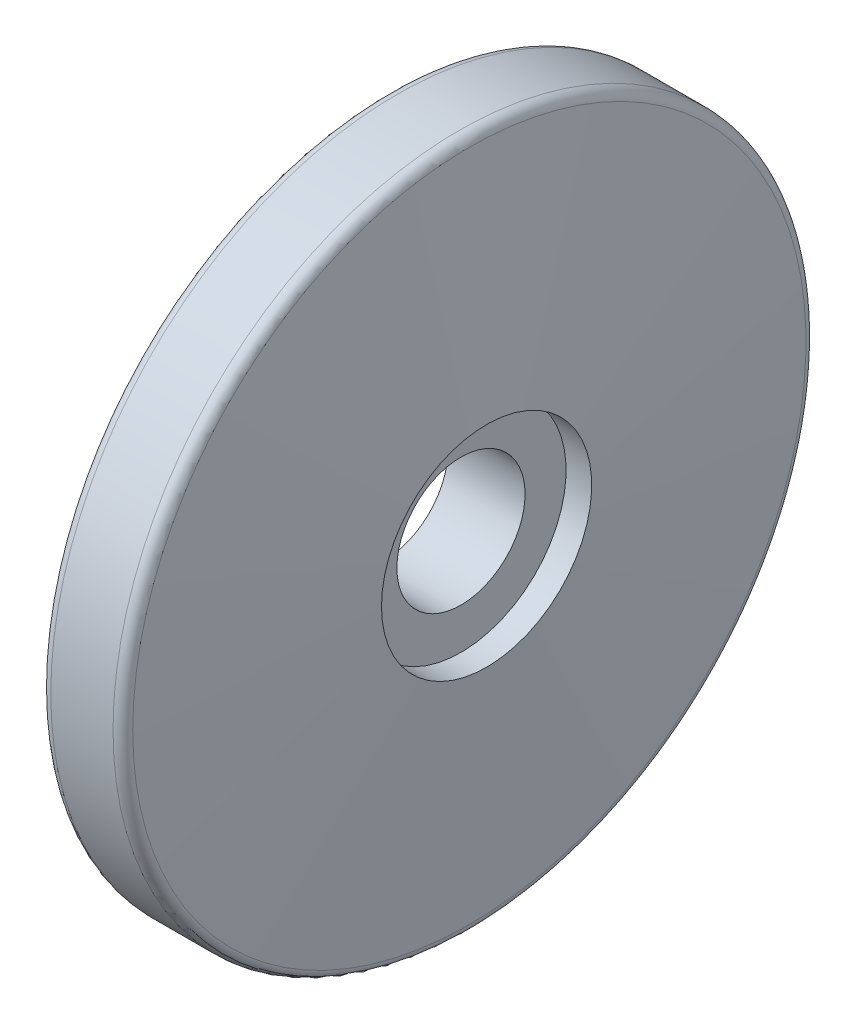
ISO-10303-21;
HEADER;
FILE_DESCRIPTION(('STEP AP214'),'2;1');
FILE_NAME('part.step','',(''),(''),'','','');
FILE_SCHEMA(('AUTOMOTIVE_DESIGN { 1 0 10303 214 1 1 1 1 }'));
ENDSEC;
DATA;
#1=APPLICATION_CONTEXT('core data for automotive mechanical design processes');
#2=APPLICATION_PROTOCOL_DEFINITION('international standard','automotive_design',2000,#1);
#3=PRODUCT_CONTEXT('',#1,'mechanical');
#4=PRODUCT('Part','Part','',(#3));
#5=PRODUCT_RELATED_PRODUCT_CATEGORY('part','',(#4));
#6=PRODUCT_DEFINITION_FORMATION('','',#4);
#7=PRODUCT_DEFINITION_CONTEXT('part definition',#1,'design');
#8=PRODUCT_DEFINITION('design','',#6,#7);
#9=PRODUCT_DEFINITION_SHAPE('','',#8);
#10=(LENGTH_UNIT() NAMED_UNIT(*) SI_UNIT(.MILLI.,.METRE.));
#11=(NAMED_UNIT(*) PLANE_ANGLE_UNIT() SI_UNIT($,.RADIAN.));
#12=(NAMED_UNIT(*) SI_UNIT($,.STERADIAN.) SOLID_ANGLE_UNIT());
#13=UNCERTAINTY_MEASURE_WITH_UNIT(LENGTH_MEASURE(1.E-05),#10,'distance_accuracy_value','');
#14=(GEOMETRIC_REPRESENTATION_CONTEXT(3) GLOBAL_UNCERTAINTY_ASSIGNED_CONTEXT((#13)) GLOBAL_UNIT_ASSIGNED_CONTEXT((#10,
#11,#12)) REPRESENTATION_CONTEXT('',''));
#15=CARTESIAN_POINT('',(0.,0.,0.));
#16=DIRECTION('',(0.,0.,1.));
#17=DIRECTION('',(1.,0.,0.));
#18=AXIS2_PLACEMENT_3D('',#15,#16,#17);
#19=CARTESIAN_POINT('',(6.42830082930007,20.4999999999999,-1.11022302462516E-13));
#20=DIRECTION('',(-0.999999999999997,0.,0.));
#21=DIRECTION('',(0.,0.,1.));
#22=AXIS2_PLACEMENT_3D('',#19,#20,#21);
#23=PLANE('',#22);
#24=CARTESIAN_POINT('',(6.42830082929979,0.,0.));
#25=DIRECTION('',(-0.999999999999997,0.,0.));
#26=DIRECTION('',(0.,0.,1.));
#27=AXIS2_PLACEMENT_3D('',#24,#25,#26);
#28=CIRCLE('',#27,20.5);
#29=CARTESIAN_POINT('',(6.4283008292998,0.,20.5));
#30=VERTEX_POINT('',#29);
#31=EDGE_CURVE('E80',#30,#30,#28,.T.);
#32=ORIENTED_EDGE('',*,*,#31,.F.);
#33=EDGE_LOOP('',(#32));
#34=FACE_BOUND('',#33,.T.);
#35=CARTESIAN_POINT('',(6.42830082929979,0.,0.));
#36=DIRECTION('',(-0.999999999999997,0.,0.));
#37=DIRECTION('',(0.,0.,1.));
#38=AXIS2_PLACEMENT_3D('',#35,#36,#37);
#39=CIRCLE('',#38,12.5);
#40=CARTESIAN_POINT('',(6.4283008292998,0.,12.5));
#41=VERTEX_POINT('',#40);
#42=EDGE_CURVE('E11',#41,#41,#39,.T.);
#43=ORIENTED_EDGE('',*,*,#42,.T.);
#44=EDGE_LOOP('',(#43));
#45=FACE_BOUND('',#44,.T.);
#46=ADVANCED_FACE('F34',(#34,#45),#23,.F.);
#47=CARTESIAN_POINT('',(-643.332684127964,2.77555756156289E-13,0.));
#48=DIRECTION('',(-0.999999999999997,0.,0.));
#49=DIRECTION('',(0.,0.,1.));
#50=AXIS2_PLACEMENT_3D('',#47,#48,#49);
#51=CYLINDRICAL_SURFACE('',#50,12.5);
#52=ORIENTED_EDGE('',*,*,#42,.F.);
#53=EDGE_LOOP('',(#52));
#54=FACE_BOUND('',#53,.T.);
#55=CARTESIAN_POINT('',(-8.57169917070022,0.,0.));
#56=DIRECTION('',(-0.999999999999997,0.,0.));
#57=DIRECTION('',(0.,0.,1.));
#58=AXIS2_PLACEMENT_3D('',#55,#56,#57);
#59=CIRCLE('',#58,12.5);
#60=CARTESIAN_POINT('',(-8.57169917070022,0.,12.5));
#61=VERTEX_POINT('',#60);
#62=EDGE_CURVE('E41',#61,#61,#59,.T.);
#63=ORIENTED_EDGE('',*,*,#62,.T.);
#64=EDGE_LOOP('',(#63));
#65=FACE_BOUND('',#64,.T.);
#66=ADVANCED_FACE('F116',(#54,#65),#51,.F.);
#67=CARTESIAN_POINT('',(-8.57169917070005,12.5,0.));
#68=DIRECTION('',(0.999999999999997,0.,0.));
#69=DIRECTION('',(0.,0.,-1.));
#70=AXIS2_PLACEMENT_3D('',#67,#68,#69);
#71=PLANE('',#70);
#72=ORIENTED_EDGE('',*,*,#62,.F.);
#73=EDGE_LOOP('',(#72));
#74=FACE_BOUND('',#73,.T.);
#75=CARTESIAN_POINT('',(-8.57169917070022,0.,0.));
#76=DIRECTION('',(-0.999999999999997,0.,0.));
#77=DIRECTION('',(0.,0.,1.));
#78=AXIS2_PLACEMENT_3D('',#75,#76,#77);
#79=CIRCLE('',#78,26.);
#80=CARTESIAN_POINT('',(-8.57169917070021,0.,26.));
#81=VERTEX_POINT('',#80);
#82=EDGE_CURVE('E45',#81,#81,#79,.T.);
#83=ORIENTED_EDGE('',*,*,#82,.T.);
#84=EDGE_LOOP('',(#83));
#85=FACE_BOUND('',#84,.T.);
#86=ADVANCED_FACE('F121',(#74,#85),#71,.F.);
#87=CARTESIAN_POINT('',(-643.332684127964,2.77555756156289E-13,0.));
#88=DIRECTION('',(-0.999999999999997,0.,0.));
#89=DIRECTION('',(0.,0.,1.));
#90=AXIS2_PLACEMENT_3D('',#87,#88,#89);
#91=CYLINDRICAL_SURFACE('',#90,26.);
#92=ORIENTED_EDGE('',*,*,#82,.F.);
#93=EDGE_LOOP('',(#92));
#94=FACE_BOUND('',#93,.T.);
#95=CARTESIAN_POINT('',(-13.0716991707002,0.,0.));
#96=DIRECTION('',(-0.999999999999997,0.,0.));
#97=DIRECTION('',(0.,0.,1.));
#98=AXIS2_PLACEMENT_3D('',#95,#96,#97);
#99=CIRCLE('',#98,26.);
#100=CARTESIAN_POINT('',(-13.0716991707002,0.,26.));
#101=VERTEX_POINT('',#100);
#102=EDGE_CURVE('E49',#101,#101,#99,.T.);
#103=ORIENTED_EDGE('',*,*,#102,.T.);
#104=EDGE_LOOP('',(#103));
#105=FACE_BOUND('',#104,.T.);
#106=ADVANCED_FACE('F194',(#94,#105),#91,.F.);
#107=CARTESIAN_POINT('',(-13.0716991706999,26.0000000000002,-1.11022302462516E-13));
#108=DIRECTION('',(0.999999999999997,0.,0.));
#109=DIRECTION('',(0.,0.,-1.));
#110=AXIS2_PLACEMENT_3D('',#107,#108,#109);
#111=PLANE('',#110);
#112=ORIENTED_EDGE('',*,*,#102,.F.);
#113=EDGE_LOOP('',(#112));
#114=FACE_BOUND('',#113,.T.);
#115=CARTESIAN_POINT('',(-13.0716991707002,0.,0.));
#116=DIRECTION('',(-0.999999999999997,0.,0.));
#117=DIRECTION('',(0.,0.,1.));
#118=AXIS2_PLACEMENT_3D('',#115,#116,#117);
#119=CIRCLE('',#118,30.);
#120=CARTESIAN_POINT('',(-13.0716991707002,0.,30.));
#121=VERTEX_POINT('',#120);
#122=EDGE_CURVE('E74',#121,#121,#119,.T.);
#123=ORIENTED_EDGE('',*,*,#122,.T.);
#124=EDGE_LOOP('',(#123));
#125=FACE_BOUND('',#124,.T.);
#126=ADVANCED_FACE('F185',(#114,#125),#111,.F.);
#127=CARTESIAN_POINT('',(-643.332684127964,2.77555756156289E-13,0.));
#128=DIRECTION('',(-0.999999999999997,0.,0.));
#129=DIRECTION('',(0.,0.,1.));
#130=AXIS2_PLACEMENT_3D('',#127,#128,#129);
#131=CYLINDRICAL_SURFACE('',#130,30.);
#132=ORIENTED_EDGE('',*,*,#122,.F.);
#133=EDGE_LOOP('',(#132));
#134=FACE_BOUND('',#133,.T.);
#135=CARTESIAN_POINT('',(-8.07169917070016,0.,0.));
#136=DIRECTION('',(-0.999999999999997,0.,0.));
#137=DIRECTION('',(0.,0.,1.));
#138=AXIS2_PLACEMENT_3D('',#135,#136,#137);
#139=CIRCLE('',#138,30.);
#140=CARTESIAN_POINT('',(-8.07169917070016,0.,30.));
#141=VERTEX_POINT('',#140);
#142=EDGE_CURVE('E68',#141,#141,#139,.T.);
#143=ORIENTED_EDGE('',*,*,#142,.T.);
#144=EDGE_LOOP('',(#143));
#145=FACE_BOUND('',#144,.T.);
#146=ADVANCED_FACE('F176',(#134,#145),#131,.T.);
#147=CARTESIAN_POINT('',(-8.07169917069994,29.9999999999999,0.));
#148=DIRECTION('',(0.999999999999997,0.,0.));
#149=DIRECTION('',(0.,0.,-1.));
#150=AXIS2_PLACEMENT_3D('',#147,#148,#149);
#151=PLANE('',#150);
#152=ORIENTED_EDGE('',*,*,#142,.F.);
#153=EDGE_LOOP('',(#152));
#154=FACE_BOUND('',#153,.T.);
#155=CARTESIAN_POINT('',(-8.07169917070016,0.,0.));
#156=DIRECTION('',(-0.999999999999997,0.,0.));
#157=DIRECTION('',(0.,0.,1.));
#158=AXIS2_PLACEMENT_3D('',#155,#156,#157);
#159=CIRCLE('',#158,65.5);
#160=CARTESIAN_POINT('',(-8.07169917070014,0.,65.5));
#161=VERTEX_POINT('',#160);
#162=EDGE_CURVE('E64',#161,#161,#159,.T.);
#163=ORIENTED_EDGE('',*,*,#162,.T.);
#164=EDGE_LOOP('',(#163));
#165=FACE_BOUND('',#164,.T.);
#166=ADVANCED_FACE('F112',(#154,#165),#151,.F.);
#167=CARTESIAN_POINT('',(-6.07169917070016,0.,0.));
#168=DIRECTION('',(-0.999999999999997,0.,0.));
#169=DIRECTION('',(0.,0.,1.));
#170=AXIS2_PLACEMENT_3D('',#167,#168,#169);
#171=TOROIDAL_SURFACE('',#170,65.5,2.);
#172=ORIENTED_EDGE('',*,*,#162,.F.);
#173=EDGE_LOOP('',(#172));
#174=FACE_BOUND('',#173,.T.);
#175=CARTESIAN_POINT('',(-6.07169917070016,0.,0.));
#176=DIRECTION('',(-0.999999999999997,0.,0.));
#177=DIRECTION('',(0.,0.,1.));
#178=AXIS2_PLACEMENT_3D('',#175,#176,#177);
#179=CIRCLE('',#178,67.5);
#180=CARTESIAN_POINT('',(-6.07169917070014,0.,67.5));
#181=VERTEX_POINT('',#180);
#182=EDGE_CURVE('E69',#181,#181,#179,.T.);
#183=ORIENTED_EDGE('',*,*,#182,.T.);
#184=EDGE_LOOP('',(#183));
#185=FACE_BOUND('',#184,.T.);
#186=ADVANCED_FACE('F99',(#174,#185),#171,.T.);
#187=CARTESIAN_POINT('',(-643.332684127964,2.77555756156289E-13,0.));
#188=DIRECTION('',(-0.999999999999997,0.,0.));
#189=DIRECTION('',(0.,0.,1.));
#190=AXIS2_PLACEMENT_3D('',#187,#188,#189);
#191=CYLINDRICAL_SURFACE('',#190,67.5);
#192=ORIENTED_EDGE('',*,*,#182,.F.);
#193=EDGE_LOOP('',(#192));
#194=FACE_BOUND('',#193,.T.);
#195=CARTESIAN_POINT('',(6.07169917070016,0.,0.));
#196=DIRECTION('',(-0.999999999999997,0.,0.));
#197=DIRECTION('',(0.,0.,1.));
#198=AXIS2_PLACEMENT_3D('',#195,#196,#197);
#199=CIRCLE('',#198,67.5);
#200=CARTESIAN_POINT('',(6.07169917070018,0.,67.5));
#201=VERTEX_POINT('',#200);
#202=EDGE_CURVE('E91',#201,#201,#199,.T.);
#203=ORIENTED_EDGE('',*,*,#202,.T.);
#204=EDGE_LOOP('',(#203));
#205=FACE_BOUND('',#204,.T.);
#206=ADVANCED_FACE('F101',(#194,#205),#191,.T.);
#207=CARTESIAN_POINT('',(6.07169917070016,0.,0.));
#208=DIRECTION('',(-0.999999999999997,0.,0.));
#209=DIRECTION('',(0.,0.,1.));
#210=AXIS2_PLACEMENT_3D('',#207,#208,#209);
#211=TOROIDAL_SURFACE('',#210,65.5,2.);
#212=ORIENTED_EDGE('',*,*,#202,.F.);
#213=EDGE_LOOP('',(#212));
#214=FACE_BOUND('',#213,.T.);
#215=CARTESIAN_POINT('',(8.0661766333211,0.,0.));
#216=DIRECTION('',(-0.999999999999997,0.,0.));
#217=DIRECTION('',(0.,0.,1.));
#218=AXIS2_PLACEMENT_3D('',#215,#216,#217);
#219=CIRCLE('',#218,65.6485249174292);
#220=CARTESIAN_POINT('',(8.06617663332112,0.,65.6485249174292));
#221=VERTEX_POINT('',#220);
#222=EDGE_CURVE('E88',#221,#221,#219,.T.);
#223=ORIENTED_EDGE('',*,*,#222,.T.);
#224=EDGE_LOOP('',(#223));
#225=FACE_BOUND('',#224,.T.);
#226=ADVANCED_FACE('F103',(#214,#225),#211,.T.);
#227=CARTESIAN_POINT('',(11.4283008292998,0.,0.));
#228=DIRECTION('',(-0.999999999999997,0.,0.));
#229=DIRECTION('',(0.,0.,1.));
#230=AXIS2_PLACEMENT_3D('',#227,#228,#229);
#231=CONICAL_SURFACE('',#230,20.5,1.49646543962723);
#232=ORIENTED_EDGE('',*,*,#222,.F.);
#233=EDGE_LOOP('',(#232));
#234=FACE_BOUND('',#233,.T.);
#235=CARTESIAN_POINT('',(11.4283008292998,0.,0.));
#236=DIRECTION('',(-0.999999999999997,0.,0.));
#237=DIRECTION('',(0.,0.,1.));
#238=AXIS2_PLACEMENT_3D('',#235,#236,#237);
#239=CIRCLE('',#238,20.5);
#240=CARTESIAN_POINT('',(11.4283008292998,0.,20.5));
#241=VERTEX_POINT('',#240);
#242=EDGE_CURVE('E84',#241,#241,#239,.T.);
#243=ORIENTED_EDGE('',*,*,#242,.T.);
#244=EDGE_LOOP('',(#243));
#245=FACE_BOUND('',#244,.T.);
#246=ADVANCED_FACE('F109',(#234,#245),#231,.T.);
#247=CARTESIAN_POINT('',(-643.332684127964,2.77555756156289E-13,0.));
#248=DIRECTION('',(-0.999999999999997,0.,0.));
#249=DIRECTION('',(0.,0.,1.));
#250=AXIS2_PLACEMENT_3D('',#247,#248,#249);
#251=CYLINDRICAL_SURFACE('',#250,20.5);
#252=ORIENTED_EDGE('',*,*,#242,.F.);
#253=EDGE_LOOP('',(#252));
#254=FACE_BOUND('',#253,.T.);
#255=ORIENTED_EDGE('',*,*,#31,.T.);
#256=EDGE_LOOP('',(#255));
#257=FACE_BOUND('',#256,.T.);
#258=ADVANCED_FACE('F125',(#254,#257),#251,.F.);
#259=CLOSED_SHELL('',(#46,#66,#86,#106,#126,#146,#166,#186,#206,#226,#246,#258));
#260=MANIFOLD_SOLID_BREP('B2',#259);
#261=ADVANCED_BREP_SHAPE_REPRESENTATION('',(#18,#260),#14);
#262=SHAPE_DEFINITION_REPRESENTATION(#9,#261);
ENDSEC;
END-ISO-10303-21;
